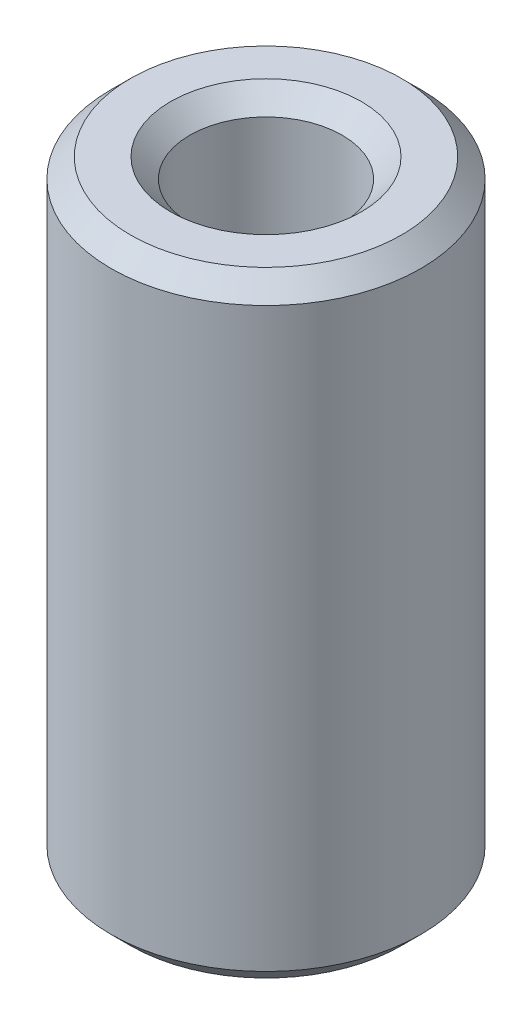
ISO-10303-21;
HEADER;
FILE_DESCRIPTION(('STEP AP214'),'2;1');
FILE_NAME('part.step','',(''),(''),'','','');
FILE_SCHEMA(('AUTOMOTIVE_DESIGN { 1 0 10303 214 1 1 1 1 }'));
ENDSEC;
DATA;
#1=APPLICATION_CONTEXT('core data for automotive mechanical design processes');
#2=APPLICATION_PROTOCOL_DEFINITION('international standard','automotive_design',2000,#1);
#3=PRODUCT_CONTEXT('',#1,'mechanical');
#4=PRODUCT('Part','Part','',(#3));
#5=PRODUCT_RELATED_PRODUCT_CATEGORY('part','',(#4));
#6=PRODUCT_DEFINITION_FORMATION('','',#4);
#7=PRODUCT_DEFINITION_CONTEXT('part definition',#1,'design');
#8=PRODUCT_DEFINITION('design','',#6,#7);
#9=PRODUCT_DEFINITION_SHAPE('','',#8);
#10=(LENGTH_UNIT() NAMED_UNIT(*) SI_UNIT(.MILLI.,.METRE.));
#11=(NAMED_UNIT(*) PLANE_ANGLE_UNIT() SI_UNIT($,.RADIAN.));
#12=(NAMED_UNIT(*) SI_UNIT($,.STERADIAN.) SOLID_ANGLE_UNIT());
#13=UNCERTAINTY_MEASURE_WITH_UNIT(LENGTH_MEASURE(1.E-05),#10,'distance_accuracy_value','');
#14=(GEOMETRIC_REPRESENTATION_CONTEXT(3) GLOBAL_UNCERTAINTY_ASSIGNED_CONTEXT((#13)) GLOBAL_UNIT_ASSIGNED_CONTEXT((#10,
#11,#12)) REPRESENTATION_CONTEXT('',''));
#15=CARTESIAN_POINT('',(0.,0.,0.));
#16=DIRECTION('',(0.,0.,1.));
#17=DIRECTION('',(1.,0.,0.));
#18=AXIS2_PLACEMENT_3D('',#15,#16,#17);
#19=CARTESIAN_POINT('',(0.,29.7884490628155,0.));
#20=DIRECTION('',(0.,-1.,0.));
#21=DIRECTION('',(0.,0.,-1.));
#22=AXIS2_PLACEMENT_3D('',#19,#20,#21);
#23=CYLINDRICAL_SURFACE('',#22,7.5);
#24=CARTESIAN_POINT('',(0.,0.937429909928272,0.));
#25=DIRECTION('',(0.,1.,0.));
#26=DIRECTION('',(0.,0.,1.));
#27=AXIS2_PLACEMENT_3D('',#24,#25,#26);
#28=CIRCLE('',#27,7.5);
#29=CARTESIAN_POINT('',(0.,0.937429909928272,7.5));
#30=VERTEX_POINT('',#29);
#31=EDGE_CURVE('E10',#30,#30,#28,.T.);
#32=ORIENTED_EDGE('',*,*,#31,.T.);
#33=EDGE_LOOP('',(#32));
#34=FACE_BOUND('',#33,.T.);
#35=CARTESIAN_POINT('',(0.,28.8510191528873,0.));
#36=DIRECTION('',(0.,1.,0.));
#37=DIRECTION('',(0.,0.,1.));
#38=AXIS2_PLACEMENT_3D('',#35,#36,#37);
#39=CIRCLE('',#38,7.5);
#40=CARTESIAN_POINT('',(0.,28.8510191528873,7.5));
#41=VERTEX_POINT('',#40);
#42=EDGE_CURVE('E50',#41,#41,#39,.F.);
#43=ORIENTED_EDGE('',*,*,#42,.T.);
#44=EDGE_LOOP('',(#43));
#45=FACE_BOUND('',#44,.T.);
#46=ADVANCED_FACE('F39',(#34,#45),#23,.T.);
#47=CARTESIAN_POINT('',(0.,29.7884490628155,0.));
#48=DIRECTION('',(0.,1.,0.));
#49=DIRECTION('',(0.,0.,1.));
#50=AXIS2_PLACEMENT_3D('',#47,#48,#49);
#51=PLANE('',#50);
#52=CARTESIAN_POINT('',(0.,29.7884490628155,0.));
#53=DIRECTION('',(0.,1.,0.));
#54=DIRECTION('',(0.,0.,1.));
#55=AXIS2_PLACEMENT_3D('',#52,#53,#54);
#56=CIRCLE('',#55,4.62178438661126);
#57=CARTESIAN_POINT('',(0.,29.7884490628155,4.62178438661126));
#58=VERTEX_POINT('',#57);
#59=EDGE_CURVE('E58',#58,#58,#56,.F.);
#60=ORIENTED_EDGE('',*,*,#59,.T.);
#61=EDGE_LOOP('',(#60));
#62=FACE_BOUND('',#61,.T.);
#63=CARTESIAN_POINT('',(0.,29.7884490628155,0.));
#64=DIRECTION('',(0.,1.,0.));
#65=DIRECTION('',(0.,0.,1.));
#66=AXIS2_PLACEMENT_3D('',#63,#64,#65);
#67=CIRCLE('',#66,6.56257009007172);
#68=CARTESIAN_POINT('',(0.,29.7884490628155,6.56257009007172));
#69=VERTEX_POINT('',#68);
#70=EDGE_CURVE('E61',#69,#69,#67,.T.);
#71=ORIENTED_EDGE('',*,*,#70,.T.);
#72=EDGE_LOOP('',(#71));
#73=FACE_BOUND('',#72,.T.);
#74=ADVANCED_FACE('F88',(#62,#73),#51,.T.);
#75=CARTESIAN_POINT('',(0.,0.,0.));
#76=DIRECTION('',(0.,1.,0.));
#77=DIRECTION('',(0.,0.,1.));
#78=AXIS2_PLACEMENT_3D('',#75,#76,#77);
#79=PLANE('',#78);
#80=CARTESIAN_POINT('',(0.,0.,0.));
#81=DIRECTION('',(0.,1.,0.));
#82=DIRECTION('',(0.,0.,1.));
#83=AXIS2_PLACEMENT_3D('',#80,#81,#82);
#84=CIRCLE('',#83,4.62178438661124);
#85=CARTESIAN_POINT('',(0.,0.,-4.62178438661124));
#86=VERTEX_POINT('',#85);
#87=EDGE_CURVE('E51',#86,#86,#84,.T.);
#88=ORIENTED_EDGE('',*,*,#87,.T.);
#89=EDGE_LOOP('',(#88));
#90=FACE_BOUND('',#89,.T.);
#91=CARTESIAN_POINT('',(0.,0.,0.));
#92=DIRECTION('',(0.,1.,0.));
#93=DIRECTION('',(0.,0.,1.));
#94=AXIS2_PLACEMENT_3D('',#91,#92,#93);
#95=CIRCLE('',#94,6.56257009007172);
#96=CARTESIAN_POINT('',(0.,0.,6.56257009007172));
#97=VERTEX_POINT('',#96);
#98=EDGE_CURVE('E54',#97,#97,#95,.F.);
#99=ORIENTED_EDGE('',*,*,#98,.T.);
#100=EDGE_LOOP('',(#99));
#101=FACE_BOUND('',#100,.T.);
#102=ADVANCED_FACE('F83',(#90,#101),#79,.F.);
#103=CARTESIAN_POINT('',(0.,29.7884490628155,0.));
#104=DIRECTION('',(0.,-1.,0.));
#105=DIRECTION('',(0.,0.,-1.));
#106=AXIS2_PLACEMENT_3D('',#103,#104,#105);
#107=CYLINDRICAL_SURFACE('',#106,3.68435447668297);
#108=CARTESIAN_POINT('',(0.,28.8510191528873,0.));
#109=DIRECTION('',(0.,1.,0.));
#110=DIRECTION('',(0.,0.,1.));
#111=AXIS2_PLACEMENT_3D('',#108,#109,#110);
#112=CIRCLE('',#111,3.68435447668297);
#113=CARTESIAN_POINT('',(0.,28.8510191528873,3.68435447668297));
#114=VERTEX_POINT('',#113);
#115=EDGE_CURVE('E67',#114,#114,#112,.T.);
#116=ORIENTED_EDGE('',*,*,#115,.T.);
#117=EDGE_LOOP('',(#116));
#118=FACE_BOUND('',#117,.T.);
#119=CARTESIAN_POINT('',(0.,0.937429909928275,0.));
#120=DIRECTION('',(0.,1.,0.));
#121=DIRECTION('',(0.,0.,1.));
#122=AXIS2_PLACEMENT_3D('',#119,#120,#121);
#123=CIRCLE('',#122,3.68435447668297);
#124=CARTESIAN_POINT('',(0.,0.937429909928275,-3.68435447668297));
#125=VERTEX_POINT('',#124);
#126=EDGE_CURVE('E69',#125,#125,#123,.F.);
#127=ORIENTED_EDGE('',*,*,#126,.T.);
#128=EDGE_LOOP('',(#127));
#129=FACE_BOUND('',#128,.T.);
#130=ADVANCED_FACE('F71',(#118,#129),#107,.F.);
#131=CARTESIAN_POINT('',(0.,28.8510191528873,0.));
#132=DIRECTION('',(0.,1.,0.));
#133=DIRECTION('',(0.,0.,1.));
#134=AXIS2_PLACEMENT_3D('',#131,#132,#133);
#135=CONICAL_SURFACE('',#134,3.68435447668297,0.785398163397453);
#136=ORIENTED_EDGE('',*,*,#59,.F.);
#137=EDGE_LOOP('',(#136));
#138=FACE_BOUND('',#137,.T.);
#139=ORIENTED_EDGE('',*,*,#115,.F.);
#140=EDGE_LOOP('',(#139));
#141=FACE_BOUND('',#140,.T.);
#142=ADVANCED_FACE('F77',(#138,#141),#135,.F.);
#143=CARTESIAN_POINT('',(0.,0.,0.));
#144=DIRECTION('',(0.,-1.,0.));
#145=DIRECTION('',(0.,0.,-1.));
#146=AXIS2_PLACEMENT_3D('',#143,#144,#145);
#147=CONICAL_SURFACE('',#146,4.62178438661124,0.785398163397446);
#148=CARTESIAN_POINT('',(0.,0.937429909928275,-3.68435447668297));
#149=CARTESIAN_POINT('',(0.,0.927665015033189,-3.69411937157806));
#150=CARTESIAN_POINT('',(0.,0.917900120138103,-3.70388426647314));
#151=CARTESIAN_POINT('',(0.,0.89837033034793,-3.72341405626331));
#152=CARTESIAN_POINT('',(0.,0.888605435452844,-3.7331789511584));
#153=CARTESIAN_POINT('',(0.,0.869075645662672,-3.75270874094857));
#154=CARTESIAN_POINT('',(0.,0.859310750767585,-3.76247363584366));
#155=CARTESIAN_POINT('',(0.,0.839780960977413,-3.78200342563383));
#156=CARTESIAN_POINT('',(0.,0.830016066082327,-3.79176832052892));
#157=CARTESIAN_POINT('',(0.,0.810486276292154,-3.81129811031909));
#158=CARTESIAN_POINT('',(0.,0.800721381397068,-3.82106300521418));
#159=CARTESIAN_POINT('',(0.,0.781191591606896,-3.84059279500435));
#160=CARTESIAN_POINT('',(0.,0.77142669671181,-3.85035768989943));
#161=CARTESIAN_POINT('',(0.,0.751896906921637,-3.86988747968961));
#162=CARTESIAN_POINT('',(0.,0.742132012026551,-3.87965237458469));
#163=CARTESIAN_POINT('',(0.,0.722602222236379,-3.89918216437486));
#164=CARTESIAN_POINT('',(0.,0.712837327341292,-3.90894705926995));
#165=CARTESIAN_POINT('',(0.,0.69330753755112,-3.92847684906012));
#166=CARTESIAN_POINT('',(0.,0.683542642656034,-3.93824174395521));
#167=CARTESIAN_POINT('',(0.,0.664012852865861,-3.95777153374538));
#168=CARTESIAN_POINT('',(0.,0.654247957970775,-3.96753642864047));
#169=CARTESIAN_POINT('',(0.,0.634718168180603,-3.98706621843064));
#170=CARTESIAN_POINT('',(0.,0.624953273285517,-3.99683111332573));
#171=CARTESIAN_POINT('',(0.,0.605423483495344,-4.0163609031159));
#172=CARTESIAN_POINT('',(0.,0.595658588600258,-4.02612579801098));
#173=CARTESIAN_POINT('',(0.,0.576128798810086,-4.04565558780116));
#174=CARTESIAN_POINT('',(0.,0.566363903914999,-4.05542048269624));
#175=CARTESIAN_POINT('',(0.,0.546834114124827,-4.07495027248642));
#176=CARTESIAN_POINT('',(0.,0.537069219229741,-4.0847151673815));
#177=CARTESIAN_POINT('',(0.,0.517539429439568,-4.10424495717167));
#178=CARTESIAN_POINT('',(0.,0.507774534544482,-4.11400985206676));
#179=CARTESIAN_POINT('',(0.,0.48824474475431,-4.13353964185693));
#180=CARTESIAN_POINT('',(0.,0.478479849859224,-4.14330453675202));
#181=CARTESIAN_POINT('',(0.,0.458950060069051,-4.16283432654219));
#182=CARTESIAN_POINT('',(0.,0.449185165173965,-4.17259922143728));
#183=CARTESIAN_POINT('',(0.,0.429655375383793,-4.19212901122745));
#184=CARTESIAN_POINT('',(0.,0.419890480488706,-4.20189390612254));
#185=CARTESIAN_POINT('',(0.,0.400360690698534,-4.22142369591271));
#186=CARTESIAN_POINT('',(0.,0.390595795803448,-4.23118859080779));
#187=CARTESIAN_POINT('',(0.,0.371066006013276,-4.25071838059797));
#188=CARTESIAN_POINT('',(0.,0.361301111118189,-4.26048327549305));
#189=CARTESIAN_POINT('',(0.,0.341771321328017,-4.28001306528322));
#190=CARTESIAN_POINT('',(0.,0.332006426432931,-4.28977796017831));
#191=CARTESIAN_POINT('',(0.,0.312476636642758,-4.30930774996848));
#192=CARTESIAN_POINT('',(0.,0.302711741747672,-4.31907264486357));
#193=CARTESIAN_POINT('',(0.,0.2831819519575,-4.33860243465374));
#194=CARTESIAN_POINT('',(0.,0.273417057062414,-4.34836732954883));
#195=CARTESIAN_POINT('',(0.,0.253887267272241,-4.367897119339));
#196=CARTESIAN_POINT('',(0.,0.244122372377155,-4.37766201423409));
#197=CARTESIAN_POINT('',(0.,0.224592582586983,-4.39719180402426));
#198=CARTESIAN_POINT('',(0.,0.214827687691896,-4.40695669891934));
#199=CARTESIAN_POINT('',(0.,0.195297897901724,-4.42648648870952));
#200=CARTESIAN_POINT('',(0.,0.185533003006638,-4.4362513836046));
#201=CARTESIAN_POINT('',(0.,0.166003213216465,-4.45578117339477));
#202=CARTESIAN_POINT('',(0.,0.156238318321379,-4.46554606828986));
#203=CARTESIAN_POINT('',(0.,0.136708528531207,-4.48507585808003));
#204=CARTESIAN_POINT('',(0.,0.126943633636121,-4.49484075297512));
#205=CARTESIAN_POINT('',(0.,0.107413843845948,-4.51437054276529));
#206=CARTESIAN_POINT('',(0.,0.097648948950862,-4.52413543766038));
#207=CARTESIAN_POINT('',(0.,0.0781191591606895,-4.54366522745055));
#208=CARTESIAN_POINT('',(0.,0.0683542642656033,-4.55343012234564));
#209=CARTESIAN_POINT('',(0.,0.0488244744754309,-4.57295991213581));
#210=CARTESIAN_POINT('',(0.,0.0390595795803448,-4.5827248070309));
#211=CARTESIAN_POINT('',(0.,0.0195297897901725,-4.60225459682107));
#212=CARTESIAN_POINT('',(0.,0.0097648948950864,-4.61201949171615));
#213=CARTESIAN_POINT('',(0.,0.,-4.62178438661124));
#214=B_SPLINE_CURVE_WITH_KNOTS('',3,(#148,#149,#150,#151,#152,#153,#154,#155,#156,#157,#158,
#159,#160,#161,#162,#163,#164,#165,#166,#167,#168,#169,#170,#171,#172,#173,#174,#175,#176,#177,
#178,#179,#180,#181,#182,#183,#184,#185,#186,#187,#188,#189,#190,#191,#192,#193,#194,#195,#196,
#197,#198,#199,#200,#201,#202,#203,#204,#205,#206,#207,#208,#209,#210,#211,#212,#213),
.UNSPECIFIED.,.F.,.F.,(4,2,2,2,2,2,2,2,2,2,2,2,2,2,2,2,2,2,2,2,2,2,2,2,2,2,2,2,2,2,2,2,4),(0.,
0.0414289403873361,0.0828578807746719,0.124286821162008,0.165715761549344,0.20714470193668,
0.248573642324016,0.290002582711352,0.331431523098688,0.372860463486024,0.41428940387336,
0.455718344260696,0.497147284648032,0.538576225035368,0.580005165422704,0.62143410581004,
0.662863046197376,0.704291986584712,0.745720926972048,0.787149867359385,0.82857880774672,
0.870007748134056,0.911436688521393,0.952865628908729,0.994294569296064,1.0357235096834,
1.07715245007074,1.11858139045807,1.16001033084541,1.20143927123274,1.24286821162008,
1.28429715200742,1.32572609239475),.UNSPECIFIED.);
#215=EDGE_CURVE('BSEAM73',#125,#86,#214,.T.);
#216=ORIENTED_EDGE('',*,*,#126,.F.);
#217=ORIENTED_EDGE('',*,*,#87,.F.);
#218=ORIENTED_EDGE('',*,*,#215,.T.);
#219=ORIENTED_EDGE('',*,*,#215,.F.);
#220=EDGE_LOOP('',(#216,#218,#217,#219));
#221=FACE_BOUND('',#220,.T.);
#222=ADVANCED_FACE('F73',(#221),#147,.F.);
#223=CARTESIAN_POINT('',(0.,0.937429909928272,0.));
#224=DIRECTION('',(0.,1.,0.));
#225=DIRECTION('',(0.,0.,1.));
#226=AXIS2_PLACEMENT_3D('',#223,#224,#225);
#227=CONICAL_SURFACE('',#226,7.5,0.785398163397452);
#228=ORIENTED_EDGE('',*,*,#98,.F.);
#229=EDGE_LOOP('',(#228));
#230=FACE_BOUND('',#229,.T.);
#231=ORIENTED_EDGE('',*,*,#31,.F.);
#232=EDGE_LOOP('',(#231));
#233=FACE_BOUND('',#232,.T.);
#234=ADVANCED_FACE('F76',(#230,#233),#227,.T.);
#235=CARTESIAN_POINT('',(0.,29.7884490628155,0.));
#236=DIRECTION('',(0.,-1.,0.));
#237=DIRECTION('',(0.,0.,-1.));
#238=AXIS2_PLACEMENT_3D('',#235,#236,#237);
#239=CONICAL_SURFACE('',#238,6.56257009007172,0.785398163397447);
#240=ORIENTED_EDGE('',*,*,#42,.F.);
#241=EDGE_LOOP('',(#240));
#242=FACE_BOUND('',#241,.T.);
#243=ORIENTED_EDGE('',*,*,#70,.F.);
#244=EDGE_LOOP('',(#243));
#245=FACE_BOUND('',#244,.T.);
#246=ADVANCED_FACE('F45',(#242,#245),#239,.T.);
#247=CLOSED_SHELL('',(#46,#74,#102,#130,#142,#222,#234,#246));
#248=MANIFOLD_SOLID_BREP('B2',#247);
#249=ADVANCED_BREP_SHAPE_REPRESENTATION('',(#18,#248),#14);
#250=SHAPE_DEFINITION_REPRESENTATION(#9,#249);
ENDSEC;
END-ISO-10303-21;
